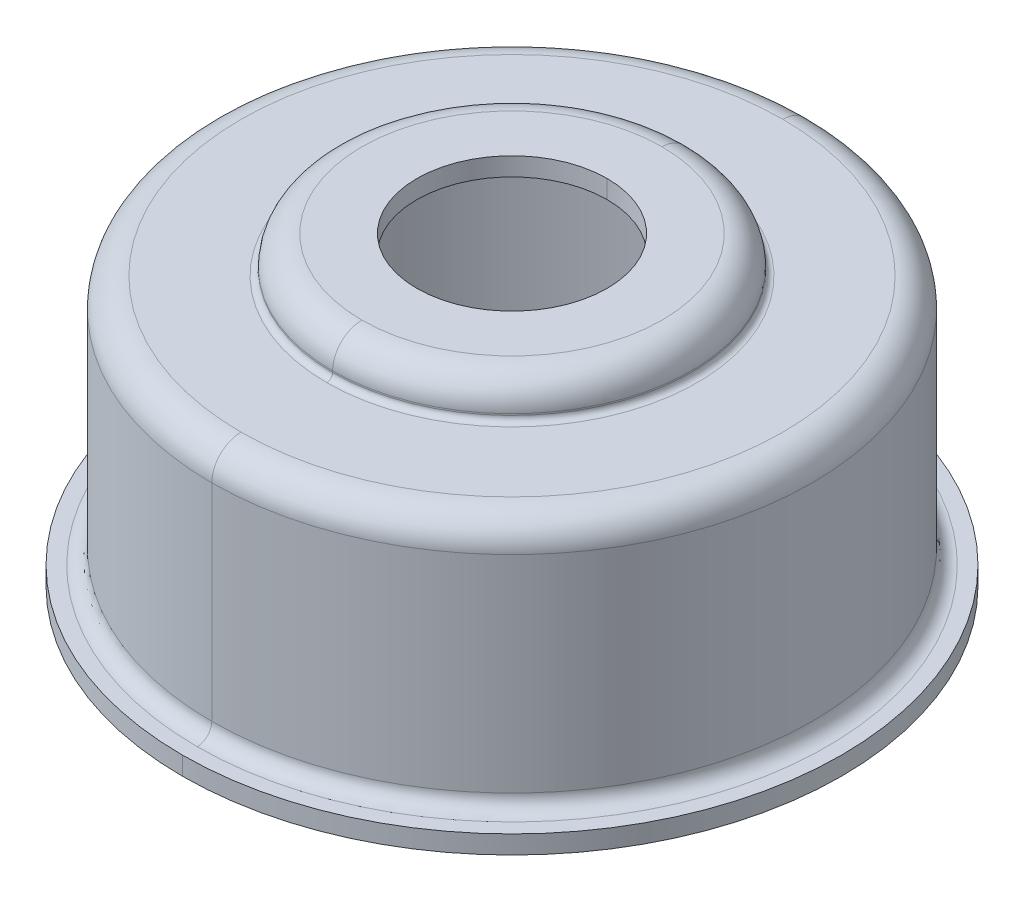
ISO-10303-21;
HEADER;
FILE_DESCRIPTION(('STEP AP214'),'2;1');
FILE_NAME('part.step','',(''),(''),'','','');
FILE_SCHEMA(('AUTOMOTIVE_DESIGN { 1 0 10303 214 1 1 1 1 }'));
ENDSEC;
DATA;
#1=APPLICATION_CONTEXT('core data for automotive mechanical design processes');
#2=APPLICATION_PROTOCOL_DEFINITION('international standard','automotive_design',2000,#1);
#3=PRODUCT_CONTEXT('',#1,'mechanical');
#4=PRODUCT('Part','Part','',(#3));
#5=PRODUCT_RELATED_PRODUCT_CATEGORY('part','',(#4));
#6=PRODUCT_DEFINITION_FORMATION('','',#4);
#7=PRODUCT_DEFINITION_CONTEXT('part definition',#1,'design');
#8=PRODUCT_DEFINITION('design','',#6,#7);
#9=PRODUCT_DEFINITION_SHAPE('','',#8);
#10=(LENGTH_UNIT() NAMED_UNIT(*) SI_UNIT(.MILLI.,.METRE.));
#11=(NAMED_UNIT(*) PLANE_ANGLE_UNIT() SI_UNIT($,.RADIAN.));
#12=(NAMED_UNIT(*) SI_UNIT($,.STERADIAN.) SOLID_ANGLE_UNIT());
#13=UNCERTAINTY_MEASURE_WITH_UNIT(LENGTH_MEASURE(1.E-05),#10,'distance_accuracy_value','');
#14=(GEOMETRIC_REPRESENTATION_CONTEXT(3) GLOBAL_UNCERTAINTY_ASSIGNED_CONTEXT((#13)) GLOBAL_UNIT_ASSIGNED_CONTEXT((#10,
#11,#12)) REPRESENTATION_CONTEXT('',''));
#15=CARTESIAN_POINT('',(0.,0.,0.));
#16=DIRECTION('',(0.,0.,1.));
#17=DIRECTION('',(1.,0.,0.));
#18=AXIS2_PLACEMENT_3D('',#15,#16,#17);
#19=CARTESIAN_POINT('',(0.,0.4,0.));
#20=DIRECTION('',(0.,-1.,0.));
#21=DIRECTION('',(0.,0.,-1.));
#22=AXIS2_PLACEMENT_3D('',#19,#20,#21);
#23=TOROIDAL_SURFACE('',#22,4.25,0.4);
#24=CARTESIAN_POINT('',(0.,0.,0.));
#25=DIRECTION('',(0.,1.,0.));
#26=DIRECTION('',(0.,0.,-1.));
#27=AXIS2_PLACEMENT_3D('',#24,#25,#26);
#28=CIRCLE('',#27,4.25);
#29=CARTESIAN_POINT('',(0.,0.,-4.25));
#30=VERTEX_POINT('',#29);
#31=CARTESIAN_POINT('',(0.,0.,4.25));
#32=VERTEX_POINT('',#31);
#33=EDGE_CURVE('E373',#30,#32,#28,.T.);
#34=ORIENTED_EDGE('',*,*,#33,.F.);
#35=CARTESIAN_POINT('',(0.,0.4,-4.25));
#36=DIRECTION('',(1.,0.,0.));
#37=DIRECTION('',(0.,0.,1.));
#38=AXIS2_PLACEMENT_3D('',#35,#36,#37);
#39=CIRCLE('',#38,0.4);
#40=CARTESIAN_POINT('',(0.,0.4,-3.85));
#41=VERTEX_POINT('',#40);
#42=EDGE_CURVE('E11',#41,#30,#39,.T.);
#43=ORIENTED_EDGE('',*,*,#42,.F.);
#44=CARTESIAN_POINT('',(0.,0.4,0.));
#45=DIRECTION('',(0.,1.,0.));
#46=DIRECTION('',(0.,0.,-1.));
#47=AXIS2_PLACEMENT_3D('',#44,#45,#46);
#48=CIRCLE('',#47,3.85);
#49=CARTESIAN_POINT('',(0.,0.4,3.85));
#50=VERTEX_POINT('',#49);
#51=EDGE_CURVE('E368',#41,#50,#48,.T.);
#52=ORIENTED_EDGE('',*,*,#51,.T.);
#53=CARTESIAN_POINT('',(0.,0.4,4.25));
#54=DIRECTION('',(-1.,0.,0.));
#55=DIRECTION('',(0.,0.,-1.));
#56=AXIS2_PLACEMENT_3D('',#53,#54,#55);
#57=CIRCLE('',#56,0.4);
#58=EDGE_CURVE('E27',#50,#32,#57,.T.);
#59=ORIENTED_EDGE('',*,*,#58,.T.);
#60=EDGE_LOOP('',(#34,#43,#52,#59));
#61=FACE_BOUND('',#60,.T.);
#62=ADVANCED_FACE('F16',(#61),#23,.T.);
#63=CARTESIAN_POINT('',(0.,0.4,0.));
#64=DIRECTION('',(0.,-1.,0.));
#65=DIRECTION('',(0.,0.,-1.));
#66=AXIS2_PLACEMENT_3D('',#63,#64,#65);
#67=TOROIDAL_SURFACE('',#66,4.25,0.4);
#68=ORIENTED_EDGE('',*,*,#58,.F.);
#69=CARTESIAN_POINT('',(0.,0.4,0.));
#70=DIRECTION('',(0.,1.,0.));
#71=DIRECTION('',(0.,0.,1.));
#72=AXIS2_PLACEMENT_3D('',#69,#70,#71);
#73=CIRCLE('',#72,3.85);
#74=EDGE_CURVE('E272',#50,#41,#73,.T.);
#75=ORIENTED_EDGE('',*,*,#74,.T.);
#76=ORIENTED_EDGE('',*,*,#42,.T.);
#77=CARTESIAN_POINT('',(0.,0.,0.));
#78=DIRECTION('',(0.,1.,0.));
#79=DIRECTION('',(0.,0.,1.));
#80=AXIS2_PLACEMENT_3D('',#77,#78,#79);
#81=CIRCLE('',#80,4.25);
#82=EDGE_CURVE('E20',#32,#30,#81,.T.);
#83=ORIENTED_EDGE('',*,*,#82,.F.);
#84=EDGE_LOOP('',(#68,#75,#76,#83));
#85=FACE_BOUND('',#84,.T.);
#86=ADVANCED_FACE('F518',(#85),#67,.T.);
#87=CARTESIAN_POINT('',(0.,0.,0.));
#88=DIRECTION('',(0.,-1.,0.));
#89=DIRECTION('',(0.,0.,-1.));
#90=AXIS2_PLACEMENT_3D('',#87,#88,#89);
#91=PLANE('',#90);
#92=ORIENTED_EDGE('',*,*,#33,.T.);
#93=ORIENTED_EDGE('',*,*,#82,.T.);
#94=EDGE_LOOP('',(#92,#93));
#95=FACE_BOUND('',#94,.T.);
#96=CARTESIAN_POINT('',(0.,0.,0.));
#97=DIRECTION('',(0.,-1.,0.));
#98=DIRECTION('',(0.,0.,1.));
#99=AXIS2_PLACEMENT_3D('',#96,#97,#98);
#100=CIRCLE('',#99,4.5);
#101=CARTESIAN_POINT('',(0.,0.,4.5));
#102=VERTEX_POINT('',#101);
#103=CARTESIAN_POINT('',(0.,0.,-4.5));
#104=VERTEX_POINT('',#103);
#105=EDGE_CURVE('E280',#102,#104,#100,.T.);
#106=ORIENTED_EDGE('',*,*,#105,.T.);
#107=CARTESIAN_POINT('',(0.,0.,0.));
#108=DIRECTION('',(0.,-1.,0.));
#109=DIRECTION('',(0.,0.,-1.));
#110=AXIS2_PLACEMENT_3D('',#107,#108,#109);
#111=CIRCLE('',#110,4.5);
#112=EDGE_CURVE('E281',#104,#102,#111,.T.);
#113=ORIENTED_EDGE('',*,*,#112,.T.);
#114=EDGE_LOOP('',(#106,#113));
#115=FACE_BOUND('',#114,.T.);
#116=ADVANCED_FACE('F522',(#95,#115),#91,.T.);
#117=CARTESIAN_POINT('',(0.,-1.474172436843,0.));
#118=DIRECTION('',(0.,-1.,0.));
#119=DIRECTION('',(0.,0.,-1.));
#120=AXIS2_PLACEMENT_3D('',#117,#118,#119);
#121=CYLINDRICAL_SURFACE('',#120,4.5);
#122=CARTESIAN_POINT('',(0.,0.25,0.));
#123=DIRECTION('',(0.,1.,0.));
#124=DIRECTION('',(0.,0.,-1.));
#125=AXIS2_PLACEMENT_3D('',#122,#123,#124);
#126=CIRCLE('',#125,4.5);
#127=CARTESIAN_POINT('',(0.,0.25,-4.5));
#128=VERTEX_POINT('',#127);
#129=CARTESIAN_POINT('',(0.,0.25,4.5));
#130=VERTEX_POINT('',#129);
#131=EDGE_CURVE('E266',#128,#130,#126,.T.);
#132=ORIENTED_EDGE('',*,*,#131,.F.);
#133=DIRECTION('',(0.,1.,0.));
#134=VECTOR('',#133,1.);
#135=CARTESIAN_POINT('',(0.,0.,-4.5));
#136=LINE('',#135,#134);
#137=EDGE_CURVE('E278',#104,#128,#136,.T.);
#138=ORIENTED_EDGE('',*,*,#137,.F.);
#139=ORIENTED_EDGE('',*,*,#105,.F.);
#140=DIRECTION('',(0.,1.,0.));
#141=VECTOR('',#140,1.);
#142=CARTESIAN_POINT('',(0.,0.,4.5));
#143=LINE('',#142,#141);
#144=EDGE_CURVE('E312',#102,#130,#143,.T.);
#145=ORIENTED_EDGE('',*,*,#144,.T.);
#146=EDGE_LOOP('',(#132,#138,#139,#145));
#147=FACE_BOUND('',#146,.T.);
#148=ADVANCED_FACE('F539',(#147),#121,.T.);
#149=CARTESIAN_POINT('',(0.,-1.474172436843,0.));
#150=DIRECTION('',(0.,-1.,0.));
#151=DIRECTION('',(0.,0.,-1.));
#152=AXIS2_PLACEMENT_3D('',#149,#150,#151);
#153=CYLINDRICAL_SURFACE('',#152,4.5);
#154=ORIENTED_EDGE('',*,*,#144,.F.);
#155=ORIENTED_EDGE('',*,*,#112,.F.);
#156=ORIENTED_EDGE('',*,*,#137,.T.);
#157=CARTESIAN_POINT('',(0.,0.25,0.));
#158=DIRECTION('',(0.,1.,0.));
#159=DIRECTION('',(0.,0.,1.));
#160=AXIS2_PLACEMENT_3D('',#157,#158,#159);
#161=CIRCLE('',#160,4.5);
#162=EDGE_CURVE('E277',#130,#128,#161,.T.);
#163=ORIENTED_EDGE('',*,*,#162,.F.);
#164=EDGE_LOOP('',(#154,#155,#156,#163));
#165=FACE_BOUND('',#164,.T.);
#166=ADVANCED_FACE('F531',(#165),#153,.T.);
#167=CARTESIAN_POINT('',(0.,0.25,0.));
#168=DIRECTION('',(0.,-1.,0.));
#169=DIRECTION('',(0.,0.,-1.));
#170=AXIS2_PLACEMENT_3D('',#167,#168,#169);
#171=PLANE('',#170);
#172=CARTESIAN_POINT('',(0.,0.25,0.));
#173=DIRECTION('',(0.,-1.,0.));
#174=DIRECTION('',(0.,0.,1.));
#175=AXIS2_PLACEMENT_3D('',#172,#173,#174);
#176=CIRCLE('',#175,4.3);
#177=CARTESIAN_POINT('',(0.,0.25,4.3));
#178=VERTEX_POINT('',#177);
#179=CARTESIAN_POINT('',(0.,0.25,-4.3));
#180=VERTEX_POINT('',#179);
#181=EDGE_CURVE('E263',#178,#180,#176,.T.);
#182=ORIENTED_EDGE('',*,*,#181,.T.);
#183=CARTESIAN_POINT('',(0.,0.25,0.));
#184=DIRECTION('',(0.,-1.,0.));
#185=DIRECTION('',(0.,0.,-1.));
#186=AXIS2_PLACEMENT_3D('',#183,#184,#185);
#187=CIRCLE('',#186,4.3);
#188=EDGE_CURVE('E400',#180,#178,#187,.T.);
#189=ORIENTED_EDGE('',*,*,#188,.T.);
#190=EDGE_LOOP('',(#182,#189));
#191=FACE_BOUND('',#190,.T.);
#192=ORIENTED_EDGE('',*,*,#131,.T.);
#193=ORIENTED_EDGE('',*,*,#162,.T.);
#194=EDGE_LOOP('',(#192,#193));
#195=FACE_BOUND('',#194,.T.);
#196=ADVANCED_FACE('F528',(#191,#195),#171,.F.);
#197=CARTESIAN_POINT('',(0.,0.45,0.));
#198=DIRECTION('',(0.,-1.,0.));
#199=DIRECTION('',(0.,0.,-1.));
#200=AXIS2_PLACEMENT_3D('',#197,#198,#199);
#201=TOROIDAL_SURFACE('',#200,4.3,0.2);
#202=CARTESIAN_POINT('',(0.,0.45,4.3));
#203=DIRECTION('',(-1.,0.,0.));
#204=DIRECTION('',(0.,0.,-1.));
#205=AXIS2_PLACEMENT_3D('',#202,#203,#204);
#206=CIRCLE('',#205,0.2);
#207=CARTESIAN_POINT('',(0.,0.45,4.1));
#208=VERTEX_POINT('',#207);
#209=EDGE_CURVE('E267',#208,#178,#206,.T.);
#210=ORIENTED_EDGE('',*,*,#209,.F.);
#211=CARTESIAN_POINT('',(0.,0.45,0.));
#212=DIRECTION('',(0.,-1.,0.));
#213=DIRECTION('',(0.,0.,1.));
#214=AXIS2_PLACEMENT_3D('',#211,#212,#213);
#215=CIRCLE('',#214,4.1);
#216=CARTESIAN_POINT('',(0.,0.45,-4.1));
#217=VERTEX_POINT('',#216);
#218=EDGE_CURVE('E345',#208,#217,#215,.T.);
#219=ORIENTED_EDGE('',*,*,#218,.T.);
#220=CARTESIAN_POINT('',(0.,0.45,-4.3));
#221=DIRECTION('',(1.,0.,0.));
#222=DIRECTION('',(0.,0.,1.));
#223=AXIS2_PLACEMENT_3D('',#220,#221,#222);
#224=CIRCLE('',#223,0.2);
#225=EDGE_CURVE('E397',#217,#180,#224,.T.);
#226=ORIENTED_EDGE('',*,*,#225,.T.);
#227=ORIENTED_EDGE('',*,*,#181,.F.);
#228=EDGE_LOOP('',(#210,#219,#226,#227));
#229=FACE_BOUND('',#228,.T.);
#230=ADVANCED_FACE('F530',(#229),#201,.F.);
#231=CARTESIAN_POINT('',(0.,0.45,0.));
#232=DIRECTION('',(0.,-1.,0.));
#233=DIRECTION('',(0.,0.,-1.));
#234=AXIS2_PLACEMENT_3D('',#231,#232,#233);
#235=TOROIDAL_SURFACE('',#234,4.3,0.2);
#236=ORIENTED_EDGE('',*,*,#188,.F.);
#237=ORIENTED_EDGE('',*,*,#225,.F.);
#238=CARTESIAN_POINT('',(0.,0.45,0.));
#239=DIRECTION('',(0.,-1.,0.));
#240=DIRECTION('',(0.,0.,-1.));
#241=AXIS2_PLACEMENT_3D('',#238,#239,#240);
#242=CIRCLE('',#241,4.1);
#243=EDGE_CURVE('E403',#217,#208,#242,.T.);
#244=ORIENTED_EDGE('',*,*,#243,.T.);
#245=ORIENTED_EDGE('',*,*,#209,.T.);
#246=EDGE_LOOP('',(#236,#237,#244,#245));
#247=FACE_BOUND('',#246,.T.);
#248=ADVANCED_FACE('F536',(#247),#235,.F.);
#249=CARTESIAN_POINT('',(0.,-1.474172436843,0.));
#250=DIRECTION('',(0.,-1.,0.));
#251=DIRECTION('',(0.,0.,-1.));
#252=AXIS2_PLACEMENT_3D('',#249,#250,#251);
#253=CYLINDRICAL_SURFACE('',#252,4.1);
#254=DIRECTION('',(0.,1.,0.));
#255=VECTOR('',#254,1.);
#256=CARTESIAN_POINT('',(0.,0.45,4.1));
#257=LINE('',#256,#255);
#258=CARTESIAN_POINT('',(0.,3.27,4.1));
#259=VERTEX_POINT('',#258);
#260=EDGE_CURVE('E349',#208,#259,#257,.T.);
#261=ORIENTED_EDGE('',*,*,#260,.F.);
#262=ORIENTED_EDGE('',*,*,#243,.F.);
#263=DIRECTION('',(0.,1.,0.));
#264=VECTOR('',#263,1.);
#265=CARTESIAN_POINT('',(0.,0.45,-4.1));
#266=LINE('',#265,#264);
#267=CARTESIAN_POINT('',(0.,3.27,-4.1));
#268=VERTEX_POINT('',#267);
#269=EDGE_CURVE('E342',#217,#268,#266,.T.);
#270=ORIENTED_EDGE('',*,*,#269,.T.);
#271=CARTESIAN_POINT('',(0.,3.27,0.));
#272=DIRECTION('',(0.,1.,0.));
#273=DIRECTION('',(0.,0.,1.));
#274=AXIS2_PLACEMENT_3D('',#271,#272,#273);
#275=CIRCLE('',#274,4.1);
#276=EDGE_CURVE('E363',#259,#268,#275,.T.);
#277=ORIENTED_EDGE('',*,*,#276,.F.);
#278=EDGE_LOOP('',(#261,#262,#270,#277));
#279=FACE_BOUND('',#278,.T.);
#280=ADVANCED_FACE('F574',(#279),#253,.T.);
#281=CARTESIAN_POINT('',(0.,-1.474172436843,0.));
#282=DIRECTION('',(0.,-1.,0.));
#283=DIRECTION('',(0.,0.,-1.));
#284=AXIS2_PLACEMENT_3D('',#281,#282,#283);
#285=CYLINDRICAL_SURFACE('',#284,4.1);
#286=CARTESIAN_POINT('',(0.,3.27,0.));
#287=DIRECTION('',(0.,1.,0.));
#288=DIRECTION('',(0.,0.,-1.));
#289=AXIS2_PLACEMENT_3D('',#286,#287,#288);
#290=CIRCLE('',#289,4.1);
#291=EDGE_CURVE('E346',#268,#259,#290,.T.);
#292=ORIENTED_EDGE('',*,*,#291,.F.);
#293=ORIENTED_EDGE('',*,*,#269,.F.);
#294=ORIENTED_EDGE('',*,*,#218,.F.);
#295=ORIENTED_EDGE('',*,*,#260,.T.);
#296=EDGE_LOOP('',(#292,#293,#294,#295));
#297=FACE_BOUND('',#296,.T.);
#298=ADVANCED_FACE('F526',(#297),#285,.T.);
#299=CARTESIAN_POINT('',(0.,3.27,0.));
#300=DIRECTION('',(0.,-1.,0.));
#301=DIRECTION('',(0.,0.,-1.));
#302=AXIS2_PLACEMENT_3D('',#299,#300,#301);
#303=TOROIDAL_SURFACE('',#302,3.7,0.4);
#304=CARTESIAN_POINT('',(0.,3.67,0.));
#305=DIRECTION('',(0.,1.,0.));
#306=DIRECTION('',(0.,0.,-1.));
#307=AXIS2_PLACEMENT_3D('',#304,#305,#306);
#308=CIRCLE('',#307,3.7);
#309=CARTESIAN_POINT('',(0.,3.67,-3.7));
#310=VERTEX_POINT('',#309);
#311=CARTESIAN_POINT('',(0.,3.67,3.7));
#312=VERTEX_POINT('',#311);
#313=EDGE_CURVE('E318',#310,#312,#308,.T.);
#314=ORIENTED_EDGE('',*,*,#313,.F.);
#315=CARTESIAN_POINT('',(0.,3.27,-3.7));
#316=DIRECTION('',(1.,0.,0.));
#317=DIRECTION('',(0.,0.,-1.));
#318=AXIS2_PLACEMENT_3D('',#315,#316,#317);
#319=CIRCLE('',#318,0.4);
#320=EDGE_CURVE('E360',#268,#310,#319,.T.);
#321=ORIENTED_EDGE('',*,*,#320,.F.);
#322=ORIENTED_EDGE('',*,*,#291,.T.);
#323=CARTESIAN_POINT('',(0.,3.27,3.7));
#324=DIRECTION('',(-1.,0.,0.));
#325=DIRECTION('',(0.,0.,1.));
#326=AXIS2_PLACEMENT_3D('',#323,#324,#325);
#327=CIRCLE('',#326,0.4);
#328=EDGE_CURVE('E410',#259,#312,#327,.T.);
#329=ORIENTED_EDGE('',*,*,#328,.T.);
#330=EDGE_LOOP('',(#314,#321,#322,#329));
#331=FACE_BOUND('',#330,.T.);
#332=ADVANCED_FACE('F557',(#331),#303,.T.);
#333=CARTESIAN_POINT('',(0.,3.27,0.));
#334=DIRECTION('',(0.,-1.,0.));
#335=DIRECTION('',(0.,0.,-1.));
#336=AXIS2_PLACEMENT_3D('',#333,#334,#335);
#337=TOROIDAL_SURFACE('',#336,3.7,0.4);
#338=ORIENTED_EDGE('',*,*,#328,.F.);
#339=ORIENTED_EDGE('',*,*,#276,.T.);
#340=ORIENTED_EDGE('',*,*,#320,.T.);
#341=CARTESIAN_POINT('',(0.,3.67,0.));
#342=DIRECTION('',(0.,1.,0.));
#343=DIRECTION('',(0.,0.,1.));
#344=AXIS2_PLACEMENT_3D('',#341,#342,#343);
#345=CIRCLE('',#344,3.7);
#346=EDGE_CURVE('E327',#312,#310,#345,.T.);
#347=ORIENTED_EDGE('',*,*,#346,.F.);
#348=EDGE_LOOP('',(#338,#339,#340,#347));
#349=FACE_BOUND('',#348,.T.);
#350=ADVANCED_FACE('F589',(#349),#337,.T.);
#351=CARTESIAN_POINT('',(0.,3.67,0.));
#352=DIRECTION('',(0.,1.,0.));
#353=DIRECTION('',(1.,0.,0.));
#354=AXIS2_PLACEMENT_3D('',#351,#352,#353);
#355=PLANE('',#354);
#356=CARTESIAN_POINT('',(0.,3.67,0.));
#357=DIRECTION('',(0.,-1.,0.));
#358=DIRECTION('',(0.,0.,1.));
#359=AXIS2_PLACEMENT_3D('',#356,#357,#358);
#360=CIRCLE('',#359,2.53);
#361=CARTESIAN_POINT('',(0.,3.67,2.53));
#362=VERTEX_POINT('',#361);
#363=CARTESIAN_POINT('',(0.,3.67,-2.53));
#364=VERTEX_POINT('',#363);
#365=EDGE_CURVE('E317',#362,#364,#360,.T.);
#366=ORIENTED_EDGE('',*,*,#365,.T.);
#367=CARTESIAN_POINT('',(0.,3.67,0.));
#368=DIRECTION('',(0.,-1.,0.));
#369=DIRECTION('',(0.,0.,-1.));
#370=AXIS2_PLACEMENT_3D('',#367,#368,#369);
#371=CIRCLE('',#370,2.53);
#372=EDGE_CURVE('E257',#364,#362,#371,.T.);
#373=ORIENTED_EDGE('',*,*,#372,.T.);
#374=EDGE_LOOP('',(#366,#373));
#375=FACE_BOUND('',#374,.T.);
#376=ORIENTED_EDGE('',*,*,#313,.T.);
#377=ORIENTED_EDGE('',*,*,#346,.T.);
#378=EDGE_LOOP('',(#376,#377));
#379=FACE_BOUND('',#378,.T.);
#380=ADVANCED_FACE('F591',(#375,#379),#355,.T.);
#381=CARTESIAN_POINT('',(0.,3.75,0.));
#382=DIRECTION('',(0.,-1.,0.));
#383=DIRECTION('',(0.,0.,-1.));
#384=AXIS2_PLACEMENT_3D('',#381,#382,#383);
#385=TOROIDAL_SURFACE('',#384,2.53,0.08);
#386=CARTESIAN_POINT('',(0.,3.75,2.53));
#387=DIRECTION('',(-1.,0.,0.));
#388=DIRECTION('',(0.,0.,-1.));
#389=AXIS2_PLACEMENT_3D('',#386,#387,#388);
#390=CIRCLE('',#389,0.08);
#391=CARTESIAN_POINT('',(0.,3.75,2.45));
#392=VERTEX_POINT('',#391);
#393=EDGE_CURVE('E319',#392,#362,#390,.T.);
#394=ORIENTED_EDGE('',*,*,#393,.F.);
#395=CARTESIAN_POINT('',(0.,3.75,0.));
#396=DIRECTION('',(0.,-1.,0.));
#397=DIRECTION('',(0.,0.,1.));
#398=AXIS2_PLACEMENT_3D('',#395,#396,#397);
#399=CIRCLE('',#398,2.45);
#400=CARTESIAN_POINT('',(0.,3.75,-2.45));
#401=VERTEX_POINT('',#400);
#402=EDGE_CURVE('E384',#392,#401,#399,.T.);
#403=ORIENTED_EDGE('',*,*,#402,.T.);
#404=CARTESIAN_POINT('',(0.,3.75,-2.53));
#405=DIRECTION('',(1.,0.,0.));
#406=DIRECTION('',(0.,0.,1.));
#407=AXIS2_PLACEMENT_3D('',#404,#405,#406);
#408=CIRCLE('',#407,0.08);
#409=EDGE_CURVE('E261',#401,#364,#408,.T.);
#410=ORIENTED_EDGE('',*,*,#409,.T.);
#411=ORIENTED_EDGE('',*,*,#365,.F.);
#412=EDGE_LOOP('',(#394,#403,#410,#411));
#413=FACE_BOUND('',#412,.T.);
#414=ADVANCED_FACE('F596',(#413),#385,.F.);
#415=CARTESIAN_POINT('',(0.,3.75,0.));
#416=DIRECTION('',(0.,-1.,0.));
#417=DIRECTION('',(0.,0.,-1.));
#418=AXIS2_PLACEMENT_3D('',#415,#416,#417);
#419=TOROIDAL_SURFACE('',#418,2.53,0.08);
#420=ORIENTED_EDGE('',*,*,#372,.F.);
#421=ORIENTED_EDGE('',*,*,#409,.F.);
#422=CARTESIAN_POINT('',(0.,3.75,0.));
#423=DIRECTION('',(0.,-1.,0.));
#424=DIRECTION('',(0.,0.,-1.));
#425=AXIS2_PLACEMENT_3D('',#422,#423,#424);
#426=CIRCLE('',#425,2.45);
#427=EDGE_CURVE('E262',#401,#392,#426,.T.);
#428=ORIENTED_EDGE('',*,*,#427,.T.);
#429=ORIENTED_EDGE('',*,*,#393,.T.);
#430=EDGE_LOOP('',(#420,#421,#428,#429));
#431=FACE_BOUND('',#430,.T.);
#432=ADVANCED_FACE('F18',(#431),#419,.F.);
#433=CARTESIAN_POINT('',(0.,-1.474172436843,0.));
#434=DIRECTION('',(0.,-1.,0.));
#435=DIRECTION('',(0.,0.,-1.));
#436=AXIS2_PLACEMENT_3D('',#433,#434,#435);
#437=CYLINDRICAL_SURFACE('',#436,2.45);
#438=DIRECTION('',(0.,1.,0.));
#439=VECTOR('',#438,1.);
#440=CARTESIAN_POINT('',(0.,3.75,2.45));
#441=LINE('',#440,#439);
#442=CARTESIAN_POINT('',(0.,3.77,2.45));
#443=VERTEX_POINT('',#442);
#444=EDGE_CURVE('E99',#392,#443,#441,.T.);
#445=ORIENTED_EDGE('',*,*,#444,.F.);
#446=ORIENTED_EDGE('',*,*,#427,.F.);
#447=DIRECTION('',(0.,1.,0.));
#448=VECTOR('',#447,1.);
#449=CARTESIAN_POINT('',(0.,3.75,-2.45));
#450=LINE('',#449,#448);
#451=CARTESIAN_POINT('',(0.,3.77,-2.45));
#452=VERTEX_POINT('',#451);
#453=EDGE_CURVE('E86',#401,#452,#450,.T.);
#454=ORIENTED_EDGE('',*,*,#453,.T.);
#455=CARTESIAN_POINT('',(0.,3.77,0.));
#456=DIRECTION('',(0.,1.,0.));
#457=DIRECTION('',(0.,0.,1.));
#458=AXIS2_PLACEMENT_3D('',#455,#456,#457);
#459=CIRCLE('',#458,2.45);
#460=EDGE_CURVE('E285',#443,#452,#459,.T.);
#461=ORIENTED_EDGE('',*,*,#460,.F.);
#462=EDGE_LOOP('',(#445,#446,#454,#461));
#463=FACE_BOUND('',#462,.T.);
#464=ADVANCED_FACE('F566',(#463),#437,.T.);
#465=CARTESIAN_POINT('',(0.,-1.474172436843,0.));
#466=DIRECTION('',(0.,-1.,0.));
#467=DIRECTION('',(0.,0.,-1.));
#468=AXIS2_PLACEMENT_3D('',#465,#466,#467);
#469=CYLINDRICAL_SURFACE('',#468,2.45);
#470=CARTESIAN_POINT('',(0.,3.77,0.));
#471=DIRECTION('',(0.,1.,0.));
#472=DIRECTION('',(0.,0.,-1.));
#473=AXIS2_PLACEMENT_3D('',#470,#471,#472);
#474=CIRCLE('',#473,2.45);
#475=EDGE_CURVE('E284',#452,#443,#474,.T.);
#476=ORIENTED_EDGE('',*,*,#475,.F.);
#477=ORIENTED_EDGE('',*,*,#453,.F.);
#478=ORIENTED_EDGE('',*,*,#402,.F.);
#479=ORIENTED_EDGE('',*,*,#444,.T.);
#480=EDGE_LOOP('',(#476,#477,#478,#479));
#481=FACE_BOUND('',#480,.T.);
#482=ADVANCED_FACE('F569',(#481),#469,.T.);
#483=CARTESIAN_POINT('',(0.,3.77,0.));
#484=DIRECTION('',(0.,-1.,0.));
#485=DIRECTION('',(0.,0.,-1.));
#486=AXIS2_PLACEMENT_3D('',#483,#484,#485);
#487=TOROIDAL_SURFACE('',#486,2.05,0.4);
#488=CARTESIAN_POINT('',(0.,4.17,0.));
#489=DIRECTION('',(0.,1.,0.));
#490=DIRECTION('',(0.,0.,-1.));
#491=AXIS2_PLACEMENT_3D('',#488,#489,#490);
#492=CIRCLE('',#491,2.05);
#493=CARTESIAN_POINT('',(0.,4.17,-2.05));
#494=VERTEX_POINT('',#493);
#495=CARTESIAN_POINT('',(0.,4.17,2.05));
#496=VERTEX_POINT('',#495);
#497=EDGE_CURVE('E316',#494,#496,#492,.T.);
#498=ORIENTED_EDGE('',*,*,#497,.F.);
#499=CARTESIAN_POINT('',(0.,3.77,-2.05));
#500=DIRECTION('',(1.,0.,0.));
#501=DIRECTION('',(0.,0.,-1.));
#502=AXIS2_PLACEMENT_3D('',#499,#500,#501);
#503=CIRCLE('',#502,0.4);
#504=EDGE_CURVE('E282',#452,#494,#503,.T.);
#505=ORIENTED_EDGE('',*,*,#504,.F.);
#506=ORIENTED_EDGE('',*,*,#475,.T.);
#507=CARTESIAN_POINT('',(0.,3.77,2.05));
#508=DIRECTION('',(-1.,0.,0.));
#509=DIRECTION('',(0.,0.,1.));
#510=AXIS2_PLACEMENT_3D('',#507,#508,#509);
#511=CIRCLE('',#510,0.4);
#512=EDGE_CURVE('E297',#443,#496,#511,.T.);
#513=ORIENTED_EDGE('',*,*,#512,.T.);
#514=EDGE_LOOP('',(#498,#505,#506,#513));
#515=FACE_BOUND('',#514,.T.);
#516=ADVANCED_FACE('F656',(#515),#487,.T.);
#517=CARTESIAN_POINT('',(0.,3.77,0.));
#518=DIRECTION('',(0.,-1.,0.));
#519=DIRECTION('',(0.,0.,-1.));
#520=AXIS2_PLACEMENT_3D('',#517,#518,#519);
#521=TOROIDAL_SURFACE('',#520,2.05,0.4);
#522=ORIENTED_EDGE('',*,*,#512,.F.);
#523=ORIENTED_EDGE('',*,*,#460,.T.);
#524=ORIENTED_EDGE('',*,*,#504,.T.);
#525=CARTESIAN_POINT('',(0.,4.17,0.));
#526=DIRECTION('',(0.,1.,0.));
#527=DIRECTION('',(0.,0.,1.));
#528=AXIS2_PLACEMENT_3D('',#525,#526,#527);
#529=CIRCLE('',#528,2.05);
#530=EDGE_CURVE('E304',#496,#494,#529,.T.);
#531=ORIENTED_EDGE('',*,*,#530,.F.);
#532=EDGE_LOOP('',(#522,#523,#524,#531));
#533=FACE_BOUND('',#532,.T.);
#534=ADVANCED_FACE('F565',(#533),#521,.T.);
#535=CARTESIAN_POINT('',(0.,4.17,0.));
#536=DIRECTION('',(0.,1.,0.));
#537=DIRECTION('',(1.,0.,0.));
#538=AXIS2_PLACEMENT_3D('',#535,#536,#537);
#539=PLANE('',#538);
#540=CARTESIAN_POINT('',(0.,4.17,0.));
#541=DIRECTION('',(0.,-1.,0.));
#542=DIRECTION('',(0.,0.,1.));
#543=AXIS2_PLACEMENT_3D('',#540,#541,#542);
#544=CIRCLE('',#543,1.3);
#545=CARTESIAN_POINT('',(0.,4.17,1.3));
#546=VERTEX_POINT('',#545);
#547=CARTESIAN_POINT('',(0.,4.17,-1.3));
#548=VERTEX_POINT('',#547);
#549=EDGE_CURVE('E340',#546,#548,#544,.T.);
#550=ORIENTED_EDGE('',*,*,#549,.T.);
#551=CARTESIAN_POINT('',(0.,4.17,0.));
#552=DIRECTION('',(0.,-1.,0.));
#553=DIRECTION('',(0.,0.,-1.));
#554=AXIS2_PLACEMENT_3D('',#551,#552,#553);
#555=CIRCLE('',#554,1.3);
#556=EDGE_CURVE('E216',#548,#546,#555,.T.);
#557=ORIENTED_EDGE('',*,*,#556,.T.);
#558=EDGE_LOOP('',(#550,#557));
#559=FACE_BOUND('',#558,.T.);
#560=ORIENTED_EDGE('',*,*,#497,.T.);
#561=ORIENTED_EDGE('',*,*,#530,.T.);
#562=EDGE_LOOP('',(#560,#561));
#563=FACE_BOUND('',#562,.T.);
#564=ADVANCED_FACE('F458',(#559,#563),#539,.T.);
#565=CARTESIAN_POINT('',(0.,-1.474172436843,0.));
#566=DIRECTION('',(0.,-1.,0.));
#567=DIRECTION('',(0.,0.,-1.));
#568=AXIS2_PLACEMENT_3D('',#565,#566,#567);
#569=CYLINDRICAL_SURFACE('',#568,1.3);
#570=DIRECTION('',(0.,1.,0.));
#571=VECTOR('',#570,1.);
#572=CARTESIAN_POINT('',(0.,3.92,1.3));
#573=LINE('',#572,#571);
#574=CARTESIAN_POINT('',(0.,3.92,1.3));
#575=VERTEX_POINT('',#574);
#576=EDGE_CURVE('E336',#575,#546,#573,.T.);
#577=ORIENTED_EDGE('',*,*,#576,.F.);
#578=CARTESIAN_POINT('',(0.,3.92,0.));
#579=DIRECTION('',(0.,1.,0.));
#580=DIRECTION('',(0.,0.,-1.));
#581=AXIS2_PLACEMENT_3D('',#578,#579,#580);
#582=CIRCLE('',#581,1.3);
#583=CARTESIAN_POINT('',(0.,3.92,-1.3));
#584=VERTEX_POINT('',#583);
#585=EDGE_CURVE('E434',#584,#575,#582,.T.);
#586=ORIENTED_EDGE('',*,*,#585,.F.);
#587=DIRECTION('',(0.,1.,0.));
#588=VECTOR('',#587,1.);
#589=CARTESIAN_POINT('',(0.,3.92,-1.3));
#590=LINE('',#589,#588);
#591=EDGE_CURVE('E341',#584,#548,#590,.T.);
#592=ORIENTED_EDGE('',*,*,#591,.T.);
#593=ORIENTED_EDGE('',*,*,#549,.F.);
#594=EDGE_LOOP('',(#577,#586,#592,#593));
#595=FACE_BOUND('',#594,.T.);
#596=ADVANCED_FACE('F467',(#595),#569,.F.);
#597=CARTESIAN_POINT('',(0.,-1.474172436843,0.));
#598=DIRECTION('',(0.,-1.,0.));
#599=DIRECTION('',(0.,0.,-1.));
#600=AXIS2_PLACEMENT_3D('',#597,#598,#599);
#601=CYLINDRICAL_SURFACE('',#600,1.3);
#602=ORIENTED_EDGE('',*,*,#556,.F.);
#603=ORIENTED_EDGE('',*,*,#591,.F.);
#604=CARTESIAN_POINT('',(0.,3.92,0.));
#605=DIRECTION('',(0.,1.,0.));
#606=DIRECTION('',(0.,0.,1.));
#607=AXIS2_PLACEMENT_3D('',#604,#605,#606);
#608=CIRCLE('',#607,1.3);
#609=EDGE_CURVE('E217',#575,#584,#608,.T.);
#610=ORIENTED_EDGE('',*,*,#609,.F.);
#611=ORIENTED_EDGE('',*,*,#576,.T.);
#612=EDGE_LOOP('',(#602,#603,#610,#611));
#613=FACE_BOUND('',#612,.T.);
#614=ADVANCED_FACE('F462',(#613),#601,.F.);
#615=CARTESIAN_POINT('',(0.,-1.474172436843,0.));
#616=DIRECTION('',(0.,-1.,0.));
#617=DIRECTION('',(0.,0.,-1.));
#618=AXIS2_PLACEMENT_3D('',#615,#616,#617);
#619=CYLINDRICAL_SURFACE('',#618,2.2);
#620=CARTESIAN_POINT('',(0.,3.72,0.));
#621=DIRECTION('',(0.,-1.,0.));
#622=DIRECTION('',(0.,0.,-1.));
#623=AXIS2_PLACEMENT_3D('',#620,#621,#622);
#624=CIRCLE('',#623,2.2);
#625=CARTESIAN_POINT('',(0.,3.72,-2.2));
#626=VERTEX_POINT('',#625);
#627=CARTESIAN_POINT('',(0.,3.72,2.2));
#628=VERTEX_POINT('',#627);
#629=EDGE_CURVE('E206',#626,#628,#624,.T.);
#630=ORIENTED_EDGE('',*,*,#629,.F.);
#631=DIRECTION('',(0.,1.,0.));
#632=VECTOR('',#631,1.);
#633=CARTESIAN_POINT('',(0.,3.7,-2.2));
#634=LINE('',#633,#632);
#635=CARTESIAN_POINT('',(0.,3.7,-2.2));
#636=VERTEX_POINT('',#635);
#637=EDGE_CURVE('E234',#636,#626,#634,.T.);
#638=ORIENTED_EDGE('',*,*,#637,.F.);
#639=CARTESIAN_POINT('',(0.,3.7,0.));
#640=DIRECTION('',(0.,1.,0.));
#641=DIRECTION('',(0.,0.,1.));
#642=AXIS2_PLACEMENT_3D('',#639,#640,#641);
#643=CIRCLE('',#642,2.2);
#644=CARTESIAN_POINT('',(0.,3.7,2.2));
#645=VERTEX_POINT('',#644);
#646=EDGE_CURVE('E240',#645,#636,#643,.T.);
#647=ORIENTED_EDGE('',*,*,#646,.F.);
#648=DIRECTION('',(0.,1.,0.));
#649=VECTOR('',#648,1.);
#650=CARTESIAN_POINT('',(0.,3.7,2.2));
#651=LINE('',#650,#649);
#652=EDGE_CURVE('E232',#645,#628,#651,.T.);
#653=ORIENTED_EDGE('',*,*,#652,.T.);
#654=EDGE_LOOP('',(#630,#638,#647,#653));
#655=FACE_BOUND('',#654,.T.);
#656=ADVANCED_FACE('F238',(#655),#619,.F.);
#657=CARTESIAN_POINT('',(0.,3.72,0.));
#658=DIRECTION('',(0.,-1.,0.));
#659=DIRECTION('',(0.,0.,-1.));
#660=AXIS2_PLACEMENT_3D('',#657,#658,#659);
#661=TOROIDAL_SURFACE('',#660,2.,0.2);
#662=CARTESIAN_POINT('',(0.,3.92,0.));
#663=DIRECTION('',(0.,-1.,0.));
#664=DIRECTION('',(0.,0.,-1.));
#665=AXIS2_PLACEMENT_3D('',#662,#663,#664);
#666=CIRCLE('',#665,2.);
#667=CARTESIAN_POINT('',(0.,3.92,-2.));
#668=VERTEX_POINT('',#667);
#669=CARTESIAN_POINT('',(0.,3.92,2.));
#670=VERTEX_POINT('',#669);
#671=EDGE_CURVE('E437',#668,#670,#666,.T.);
#672=ORIENTED_EDGE('',*,*,#671,.F.);
#673=CARTESIAN_POINT('',(0.,3.72,-2.));
#674=DIRECTION('',(1.,0.,0.));
#675=DIRECTION('',(0.,0.,-1.));
#676=AXIS2_PLACEMENT_3D('',#673,#674,#675);
#677=CIRCLE('',#676,0.2);
#678=EDGE_CURVE('E211',#626,#668,#677,.T.);
#679=ORIENTED_EDGE('',*,*,#678,.F.);
#680=ORIENTED_EDGE('',*,*,#629,.T.);
#681=CARTESIAN_POINT('',(0.,3.72,2.));
#682=DIRECTION('',(-1.,0.,0.));
#683=DIRECTION('',(0.,0.,1.));
#684=AXIS2_PLACEMENT_3D('',#681,#682,#683);
#685=CIRCLE('',#684,0.2);
#686=EDGE_CURVE('E209',#628,#670,#685,.T.);
#687=ORIENTED_EDGE('',*,*,#686,.T.);
#688=EDGE_LOOP('',(#672,#679,#680,#687));
#689=FACE_BOUND('',#688,.T.);
#690=ADVANCED_FACE('F208',(#689),#661,.F.);
#691=CARTESIAN_POINT('',(0.,3.92,0.));
#692=DIRECTION('',(0.,1.,0.));
#693=DIRECTION('',(1.,0.,0.));
#694=AXIS2_PLACEMENT_3D('',#691,#692,#693);
#695=PLANE('',#694);
#696=ORIENTED_EDGE('',*,*,#585,.T.);
#697=ORIENTED_EDGE('',*,*,#609,.T.);
#698=EDGE_LOOP('',(#696,#697));
#699=FACE_BOUND('',#698,.T.);
#700=CARTESIAN_POINT('',(0.,3.92,0.));
#701=DIRECTION('',(0.,-1.,0.));
#702=DIRECTION('',(0.,0.,1.));
#703=AXIS2_PLACEMENT_3D('',#700,#701,#702);
#704=CIRCLE('',#703,2.);
#705=EDGE_CURVE('E226',#670,#668,#704,.T.);
#706=ORIENTED_EDGE('',*,*,#705,.T.);
#707=ORIENTED_EDGE('',*,*,#671,.T.);
#708=EDGE_LOOP('',(#706,#707));
#709=FACE_BOUND('',#708,.T.);
#710=ADVANCED_FACE('F469',(#699,#709),#695,.F.);
#711=CARTESIAN_POINT('',(0.,3.72,0.));
#712=DIRECTION('',(0.,-1.,0.));
#713=DIRECTION('',(0.,0.,-1.));
#714=AXIS2_PLACEMENT_3D('',#711,#712,#713);
#715=TOROIDAL_SURFACE('',#714,2.,0.2);
#716=ORIENTED_EDGE('',*,*,#686,.F.);
#717=CARTESIAN_POINT('',(0.,3.72,0.));
#718=DIRECTION('',(0.,-1.,0.));
#719=DIRECTION('',(0.,0.,1.));
#720=AXIS2_PLACEMENT_3D('',#717,#718,#719);
#721=CIRCLE('',#720,2.2);
#722=EDGE_CURVE('E223',#628,#626,#721,.T.);
#723=ORIENTED_EDGE('',*,*,#722,.T.);
#724=ORIENTED_EDGE('',*,*,#678,.T.);
#725=ORIENTED_EDGE('',*,*,#705,.F.);
#726=EDGE_LOOP('',(#716,#723,#724,#725));
#727=FACE_BOUND('',#726,.T.);
#728=ADVANCED_FACE('F222',(#727),#715,.F.);
#729=CARTESIAN_POINT('',(0.,-1.474172436843,0.));
#730=DIRECTION('',(0.,-1.,0.));
#731=DIRECTION('',(0.,0.,-1.));
#732=AXIS2_PLACEMENT_3D('',#729,#730,#731);
#733=CYLINDRICAL_SURFACE('',#732,2.2);
#734=ORIENTED_EDGE('',*,*,#652,.F.);
#735=CARTESIAN_POINT('',(0.,3.7,0.));
#736=DIRECTION('',(0.,1.,0.));
#737=DIRECTION('',(0.,0.,-1.));
#738=AXIS2_PLACEMENT_3D('',#735,#736,#737);
#739=CIRCLE('',#738,2.2);
#740=EDGE_CURVE('E243',#636,#645,#739,.T.);
#741=ORIENTED_EDGE('',*,*,#740,.F.);
#742=ORIENTED_EDGE('',*,*,#637,.T.);
#743=ORIENTED_EDGE('',*,*,#722,.F.);
#744=EDGE_LOOP('',(#734,#741,#742,#743));
#745=FACE_BOUND('',#744,.T.);
#746=ADVANCED_FACE('F230',(#745),#733,.F.);
#747=CARTESIAN_POINT('',(0.,3.7,0.));
#748=DIRECTION('',(0.,-1.,0.));
#749=DIRECTION('',(0.,0.,-1.));
#750=AXIS2_PLACEMENT_3D('',#747,#748,#749);
#751=TOROIDAL_SURFACE('',#750,2.48,0.28);
#752=CARTESIAN_POINT('',(0.,3.42,0.));
#753=DIRECTION('',(0.,1.,0.));
#754=DIRECTION('',(0.,0.,-1.));
#755=AXIS2_PLACEMENT_3D('',#752,#753,#754);
#756=CIRCLE('',#755,2.48);
#757=CARTESIAN_POINT('',(0.,3.42,-2.48));
#758=VERTEX_POINT('',#757);
#759=CARTESIAN_POINT('',(0.,3.42,2.48));
#760=VERTEX_POINT('',#759);
#761=EDGE_CURVE('E351',#758,#760,#756,.T.);
#762=ORIENTED_EDGE('',*,*,#761,.F.);
#763=CARTESIAN_POINT('',(0.,3.7,-2.48));
#764=DIRECTION('',(1.,0.,0.));
#765=DIRECTION('',(0.,0.,1.));
#766=AXIS2_PLACEMENT_3D('',#763,#764,#765);
#767=CIRCLE('',#766,0.28);
#768=EDGE_CURVE('E251',#636,#758,#767,.T.);
#769=ORIENTED_EDGE('',*,*,#768,.F.);
#770=ORIENTED_EDGE('',*,*,#740,.T.);
#771=CARTESIAN_POINT('',(0.,3.7,2.48));
#772=DIRECTION('',(-1.,0.,0.));
#773=DIRECTION('',(0.,0.,-1.));
#774=AXIS2_PLACEMENT_3D('',#771,#772,#773);
#775=CIRCLE('',#774,0.28);
#776=EDGE_CURVE('E379',#645,#760,#775,.T.);
#777=ORIENTED_EDGE('',*,*,#776,.T.);
#778=EDGE_LOOP('',(#762,#769,#770,#777));
#779=FACE_BOUND('',#778,.T.);
#780=ADVANCED_FACE('F562',(#779),#751,.T.);
#781=CARTESIAN_POINT('',(0.,3.7,0.));
#782=DIRECTION('',(0.,-1.,0.));
#783=DIRECTION('',(0.,0.,-1.));
#784=AXIS2_PLACEMENT_3D('',#781,#782,#783);
#785=TOROIDAL_SURFACE('',#784,2.48,0.28);
#786=ORIENTED_EDGE('',*,*,#776,.F.);
#787=ORIENTED_EDGE('',*,*,#646,.T.);
#788=ORIENTED_EDGE('',*,*,#768,.T.);
#789=CARTESIAN_POINT('',(0.,3.42,0.));
#790=DIRECTION('',(0.,1.,0.));
#791=DIRECTION('',(0.,0.,1.));
#792=AXIS2_PLACEMENT_3D('',#789,#790,#791);
#793=CIRCLE('',#792,2.48);
#794=EDGE_CURVE('E355',#760,#758,#793,.T.);
#795=ORIENTED_EDGE('',*,*,#794,.F.);
#796=EDGE_LOOP('',(#786,#787,#788,#795));
#797=FACE_BOUND('',#796,.T.);
#798=ADVANCED_FACE('F514',(#797),#785,.T.);
#799=CARTESIAN_POINT('',(0.,3.22,0.));
#800=DIRECTION('',(0.,-1.,0.));
#801=DIRECTION('',(0.,0.,-1.));
#802=AXIS2_PLACEMENT_3D('',#799,#800,#801);
#803=TOROIDAL_SURFACE('',#802,3.65,0.2);
#804=CARTESIAN_POINT('',(0.,3.42,0.));
#805=DIRECTION('',(0.,-1.,0.));
#806=DIRECTION('',(0.,0.,-1.));
#807=AXIS2_PLACEMENT_3D('',#804,#805,#806);
#808=CIRCLE('',#807,3.65);
#809=CARTESIAN_POINT('',(0.,3.42,-3.65));
#810=VERTEX_POINT('',#809);
#811=CARTESIAN_POINT('',(0.,3.42,3.65));
#812=VERTEX_POINT('',#811);
#813=EDGE_CURVE('E356',#810,#812,#808,.T.);
#814=ORIENTED_EDGE('',*,*,#813,.F.);
#815=CARTESIAN_POINT('',(0.,3.22,-3.65));
#816=DIRECTION('',(1.,0.,0.));
#817=DIRECTION('',(0.,0.,-1.));
#818=AXIS2_PLACEMENT_3D('',#815,#816,#817);
#819=CIRCLE('',#818,0.2);
#820=CARTESIAN_POINT('',(0.,3.22,-3.85));
#821=VERTEX_POINT('',#820);
#822=EDGE_CURVE('E332',#821,#810,#819,.T.);
#823=ORIENTED_EDGE('',*,*,#822,.F.);
#824=CARTESIAN_POINT('',(0.,3.22,0.));
#825=DIRECTION('',(0.,-1.,0.));
#826=DIRECTION('',(0.,0.,-1.));
#827=AXIS2_PLACEMENT_3D('',#824,#825,#826);
#828=CIRCLE('',#827,3.85);
#829=CARTESIAN_POINT('',(0.,3.22,3.85));
#830=VERTEX_POINT('',#829);
#831=EDGE_CURVE('E273',#821,#830,#828,.T.);
#832=ORIENTED_EDGE('',*,*,#831,.T.);
#833=CARTESIAN_POINT('',(0.,3.22,3.65));
#834=DIRECTION('',(-1.,0.,0.));
#835=DIRECTION('',(0.,0.,1.));
#836=AXIS2_PLACEMENT_3D('',#833,#834,#835);
#837=CIRCLE('',#836,0.2);
#838=EDGE_CURVE('E328',#830,#812,#837,.T.);
#839=ORIENTED_EDGE('',*,*,#838,.T.);
#840=EDGE_LOOP('',(#814,#823,#832,#839));
#841=FACE_BOUND('',#840,.T.);
#842=ADVANCED_FACE('F504',(#841),#803,.F.);
#843=CARTESIAN_POINT('',(0.,3.42,0.));
#844=DIRECTION('',(0.,1.,0.));
#845=DIRECTION('',(1.,0.,0.));
#846=AXIS2_PLACEMENT_3D('',#843,#844,#845);
#847=PLANE('',#846);
#848=ORIENTED_EDGE('',*,*,#761,.T.);
#849=ORIENTED_EDGE('',*,*,#794,.T.);
#850=EDGE_LOOP('',(#848,#849));
#851=FACE_BOUND('',#850,.T.);
#852=CARTESIAN_POINT('',(0.,3.42,0.));
#853=DIRECTION('',(0.,-1.,0.));
#854=DIRECTION('',(0.,0.,1.));
#855=AXIS2_PLACEMENT_3D('',#852,#853,#854);
#856=CIRCLE('',#855,3.65);
#857=EDGE_CURVE('E359',#812,#810,#856,.T.);
#858=ORIENTED_EDGE('',*,*,#857,.T.);
#859=ORIENTED_EDGE('',*,*,#813,.T.);
#860=EDGE_LOOP('',(#858,#859));
#861=FACE_BOUND('',#860,.T.);
#862=ADVANCED_FACE('F506',(#851,#861),#847,.F.);
#863=CARTESIAN_POINT('',(0.,3.22,0.));
#864=DIRECTION('',(0.,-1.,0.));
#865=DIRECTION('',(0.,0.,-1.));
#866=AXIS2_PLACEMENT_3D('',#863,#864,#865);
#867=TOROIDAL_SURFACE('',#866,3.65,0.2);
#868=ORIENTED_EDGE('',*,*,#838,.F.);
#869=CARTESIAN_POINT('',(0.,3.22,0.));
#870=DIRECTION('',(0.,-1.,0.));
#871=DIRECTION('',(0.,0.,1.));
#872=AXIS2_PLACEMENT_3D('',#869,#870,#871);
#873=CIRCLE('',#872,3.85);
#874=EDGE_CURVE('E255',#830,#821,#873,.T.);
#875=ORIENTED_EDGE('',*,*,#874,.T.);
#876=ORIENTED_EDGE('',*,*,#822,.T.);
#877=ORIENTED_EDGE('',*,*,#857,.F.);
#878=EDGE_LOOP('',(#868,#875,#876,#877));
#879=FACE_BOUND('',#878,.T.);
#880=ADVANCED_FACE('F494',(#879),#867,.F.);
#881=CARTESIAN_POINT('',(0.,-1.474172436843,0.));
#882=DIRECTION('',(0.,-1.,0.));
#883=DIRECTION('',(0.,0.,-1.));
#884=AXIS2_PLACEMENT_3D('',#881,#882,#883);
#885=CYLINDRICAL_SURFACE('',#884,3.85);
#886=DIRECTION('',(0.,1.,0.));
#887=VECTOR('',#886,1.);
#888=CARTESIAN_POINT('',(0.,0.4,3.85));
#889=LINE('',#888,#887);
#890=EDGE_CURVE('E364',#50,#830,#889,.T.);
#891=ORIENTED_EDGE('',*,*,#890,.F.);
#892=ORIENTED_EDGE('',*,*,#51,.F.);
#893=DIRECTION('',(0.,1.,0.));
#894=VECTOR('',#893,1.);
#895=CARTESIAN_POINT('',(0.,0.4,-3.85));
#896=LINE('',#895,#894);
#897=EDGE_CURVE('E268',#41,#821,#896,.T.);
#898=ORIENTED_EDGE('',*,*,#897,.T.);
#899=ORIENTED_EDGE('',*,*,#874,.F.);
#900=EDGE_LOOP('',(#891,#892,#898,#899));
#901=FACE_BOUND('',#900,.T.);
#902=ADVANCED_FACE('F499',(#901),#885,.F.);
#903=CARTESIAN_POINT('',(0.,-1.474172436843,0.));
#904=DIRECTION('',(0.,-1.,0.));
#905=DIRECTION('',(0.,0.,-1.));
#906=AXIS2_PLACEMENT_3D('',#903,#904,#905);
#907=CYLINDRICAL_SURFACE('',#906,3.85);
#908=ORIENTED_EDGE('',*,*,#831,.F.);
#909=ORIENTED_EDGE('',*,*,#897,.F.);
#910=ORIENTED_EDGE('',*,*,#74,.F.);
#911=ORIENTED_EDGE('',*,*,#890,.T.);
#912=EDGE_LOOP('',(#908,#909,#910,#911));
#913=FACE_BOUND('',#912,.T.);
#914=ADVANCED_FACE('F502',(#913),#907,.F.);
#915=CLOSED_SHELL('',(#62,#86,#116,#148,#166,#196,#230,#248,#280,#298,#332,#350,#380,#414,#432,
#464,#482,#516,#534,#564,#596,#614,#656,#690,#710,#728,#746,#780,#798,#842,#862,#880,#902,#914));
#916=MANIFOLD_SOLID_BREP('B1',#915);
#917=ADVANCED_BREP_SHAPE_REPRESENTATION('',(#18,#916),#14);
#918=SHAPE_DEFINITION_REPRESENTATION(#9,#917);
ENDSEC;
END-ISO-10303-21;
